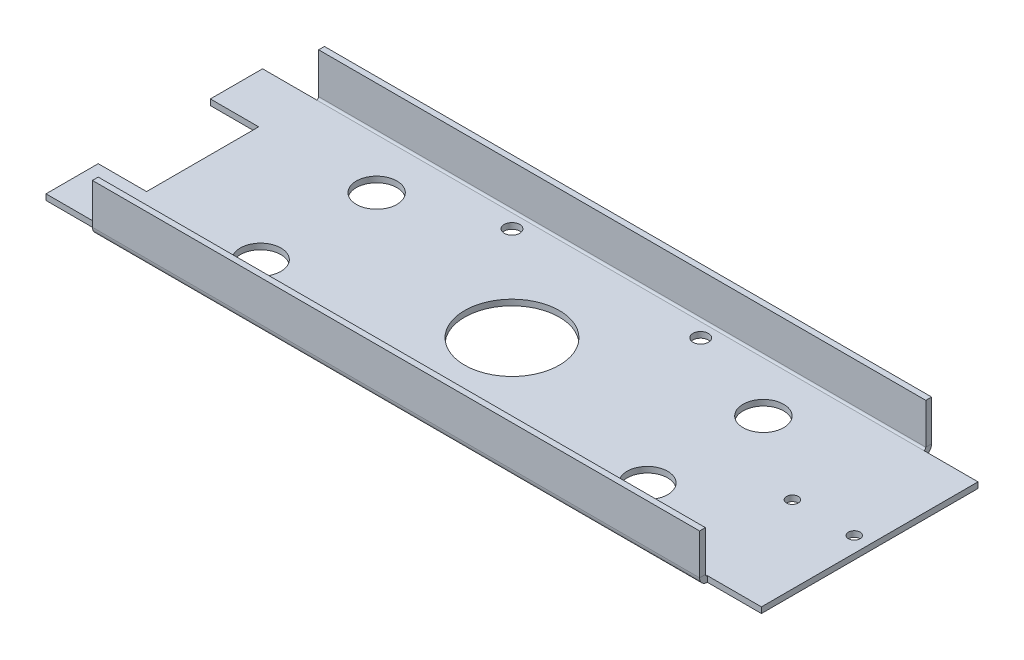
ISO-10303-21;
HEADER;
FILE_DESCRIPTION(('STEP AP214'),'2;1');
FILE_NAME('part.step','',(''),(''),'','','');
FILE_SCHEMA(('AUTOMOTIVE_DESIGN { 1 0 10303 214 1 1 1 1 }'));
ENDSEC;
DATA;
#1=APPLICATION_CONTEXT('core data for automotive mechanical design processes');
#2=APPLICATION_PROTOCOL_DEFINITION('international standard','automotive_design',2000,#1);
#3=PRODUCT_CONTEXT('',#1,'mechanical');
#4=PRODUCT('Part','Part','',(#3));
#5=PRODUCT_RELATED_PRODUCT_CATEGORY('part','',(#4));
#6=PRODUCT_DEFINITION_FORMATION('','',#4);
#7=PRODUCT_DEFINITION_CONTEXT('part definition',#1,'design');
#8=PRODUCT_DEFINITION('design','',#6,#7);
#9=PRODUCT_DEFINITION_SHAPE('','',#8);
#10=(LENGTH_UNIT() NAMED_UNIT(*) SI_UNIT(.MILLI.,.METRE.));
#11=(NAMED_UNIT(*) PLANE_ANGLE_UNIT() SI_UNIT($,.RADIAN.));
#12=(NAMED_UNIT(*) SI_UNIT($,.STERADIAN.) SOLID_ANGLE_UNIT());
#13=UNCERTAINTY_MEASURE_WITH_UNIT(LENGTH_MEASURE(1.E-05),#10,'distance_accuracy_value','');
#14=(GEOMETRIC_REPRESENTATION_CONTEXT(3) GLOBAL_UNCERTAINTY_ASSIGNED_CONTEXT((#13)) GLOBAL_UNIT_ASSIGNED_CONTEXT((#10,
#11,#12)) REPRESENTATION_CONTEXT('',''));
#15=CARTESIAN_POINT('',(0.,0.,0.));
#16=DIRECTION('',(0.,0.,1.));
#17=DIRECTION('',(1.,0.,0.));
#18=AXIS2_PLACEMENT_3D('',#15,#16,#17);
#19=CARTESIAN_POINT('',(185.,3.99999999999999,56.));
#20=DIRECTION('',(1.,0.,0.));
#21=DIRECTION('',(0.,0.,1.));
#22=AXIS2_PLACEMENT_3D('',#19,#20,#21);
#23=CYLINDRICAL_SURFACE('',#22,4.);
#24=DIRECTION('',(-1.,0.,0.));
#25=VECTOR('',#24,1.);
#26=CARTESIAN_POINT('',(0.,3.99999999999999,60.));
#27=LINE('',#26,#25);
#28=CARTESIAN_POINT('',(157.,4.00000000000002,60.));
#29=VERTEX_POINT('',#28);
#30=CARTESIAN_POINT('',(-157.,4.00000000000002,60.));
#31=VERTEX_POINT('',#30);
#32=EDGE_CURVE('E238',#29,#31,#27,.T.);
#33=ORIENTED_EDGE('',*,*,#32,.T.);
#34=CARTESIAN_POINT('',(-157.,3.99999999999999,56.));
#35=DIRECTION('',(1.,0.,0.));
#36=DIRECTION('',(0.,0.,-1.));
#37=AXIS2_PLACEMENT_3D('',#34,#35,#36);
#38=CIRCLE('',#37,4.);
#39=CARTESIAN_POINT('',(-157.,0.,56.));
#40=VERTEX_POINT('',#39);
#41=EDGE_CURVE('E436',#40,#31,#38,.F.);
#42=ORIENTED_EDGE('',*,*,#41,.F.);
#43=DIRECTION('',(1.,0.,0.));
#44=VECTOR('',#43,1.);
#45=CARTESIAN_POINT('',(185.,0.,56.));
#46=LINE('',#45,#44);
#47=CARTESIAN_POINT('',(157.,0.,56.));
#48=VERTEX_POINT('',#47);
#49=EDGE_CURVE('E252',#48,#40,#46,.F.);
#50=ORIENTED_EDGE('',*,*,#49,.F.);
#51=CARTESIAN_POINT('',(157.,3.99999999999999,56.));
#52=DIRECTION('',(1.,0.,0.));
#53=DIRECTION('',(0.,0.,-1.));
#54=AXIS2_PLACEMENT_3D('',#51,#52,#53);
#55=CIRCLE('',#54,4.);
#56=EDGE_CURVE('E490',#29,#48,#55,.T.);
#57=ORIENTED_EDGE('',*,*,#56,.F.);
#58=EDGE_LOOP('',(#33,#42,#50,#57));
#59=FACE_BOUND('',#58,.T.);
#60=ADVANCED_FACE('F38',(#59),#23,.T.);
#61=CARTESIAN_POINT('',(185.,3.99999999999999,56.));
#62=DIRECTION('',(1.,0.,0.));
#63=DIRECTION('',(0.,0.,1.));
#64=AXIS2_PLACEMENT_3D('',#61,#62,#63);
#65=CYLINDRICAL_SURFACE('',#64,1.);
#66=CARTESIAN_POINT('',(-157.,3.99999999999999,56.));
#67=DIRECTION('',(-1.,0.,0.));
#68=DIRECTION('',(0.,0.,1.));
#69=AXIS2_PLACEMENT_3D('',#66,#67,#68);
#70=CIRCLE('',#69,1.);
#71=CARTESIAN_POINT('',(-157.,2.99999999999999,56.));
#72=VERTEX_POINT('',#71);
#73=CARTESIAN_POINT('',(-157.,4.00000000000001,57.));
#74=VERTEX_POINT('',#73);
#75=EDGE_CURVE('E445',#72,#74,#70,.T.);
#76=ORIENTED_EDGE('',*,*,#75,.T.);
#77=DIRECTION('',(1.,0.,0.));
#78=VECTOR('',#77,1.);
#79=CARTESIAN_POINT('',(-185.,4.,57.));
#80=LINE('',#79,#78);
#81=CARTESIAN_POINT('',(157.,3.99999999999998,57.));
#82=VERTEX_POINT('',#81);
#83=EDGE_CURVE('E233',#74,#82,#80,.T.);
#84=ORIENTED_EDGE('',*,*,#83,.T.);
#85=CARTESIAN_POINT('',(157.,3.99999999999999,56.));
#86=DIRECTION('',(1.,0.,0.));
#87=DIRECTION('',(0.,0.,-1.));
#88=AXIS2_PLACEMENT_3D('',#85,#86,#87);
#89=CIRCLE('',#88,1.);
#90=CARTESIAN_POINT('',(157.,2.99999999999999,56.));
#91=VERTEX_POINT('',#90);
#92=EDGE_CURVE('E493',#82,#91,#89,.T.);
#93=ORIENTED_EDGE('',*,*,#92,.T.);
#94=DIRECTION('',(1.,0.,0.));
#95=VECTOR('',#94,1.);
#96=CARTESIAN_POINT('',(185.,2.99999999999999,56.));
#97=LINE('',#96,#95);
#98=EDGE_CURVE('E245',#91,#72,#97,.F.);
#99=ORIENTED_EDGE('',*,*,#98,.T.);
#100=EDGE_LOOP('',(#76,#84,#93,#99));
#101=FACE_BOUND('',#100,.T.);
#102=ADVANCED_FACE('F316',(#101),#65,.F.);
#103=CARTESIAN_POINT('',(0.,0.,60.));
#104=DIRECTION('',(0.,0.,-1.));
#105=DIRECTION('',(-1.,0.,0.));
#106=AXIS2_PLACEMENT_3D('',#103,#104,#105);
#107=PLANE('',#106);
#108=DIRECTION('',(0.,1.,0.));
#109=VECTOR('',#108,1.);
#110=CARTESIAN_POINT('',(-157.,0.,60.));
#111=LINE('',#110,#109);
#112=CARTESIAN_POINT('',(-157.,25.,60.));
#113=VERTEX_POINT('',#112);
#114=EDGE_CURVE('E55',#113,#31,#111,.F.);
#115=ORIENTED_EDGE('',*,*,#114,.T.);
#116=ORIENTED_EDGE('',*,*,#32,.F.);
#117=DIRECTION('',(0.,1.,0.));
#118=VECTOR('',#117,1.);
#119=CARTESIAN_POINT('',(157.,14.5,60.));
#120=LINE('',#119,#118);
#121=CARTESIAN_POINT('',(157.,25.,60.));
#122=VERTEX_POINT('',#121);
#123=EDGE_CURVE('E473',#122,#29,#120,.F.);
#124=ORIENTED_EDGE('',*,*,#123,.F.);
#125=DIRECTION('',(-1.,0.,0.));
#126=VECTOR('',#125,1.);
#127=CARTESIAN_POINT('',(-185.,25.,60.));
#128=LINE('',#127,#126);
#129=EDGE_CURVE('E242',#122,#113,#128,.T.);
#130=ORIENTED_EDGE('',*,*,#129,.T.);
#131=EDGE_LOOP('',(#115,#116,#124,#130));
#132=FACE_BOUND('',#131,.T.);
#133=ADVANCED_FACE('F322',(#132),#107,.F.);
#134=CARTESIAN_POINT('',(0.,0.,57.));
#135=DIRECTION('',(0.,0.,-1.));
#136=DIRECTION('',(-1.,0.,0.));
#137=AXIS2_PLACEMENT_3D('',#134,#135,#136);
#138=PLANE('',#137);
#139=ORIENTED_EDGE('',*,*,#83,.F.);
#140=DIRECTION('',(0.,-1.,0.));
#141=VECTOR('',#140,1.);
#142=CARTESIAN_POINT('',(-157.,0.,57.));
#143=LINE('',#142,#141);
#144=CARTESIAN_POINT('',(-157.,25.,57.));
#145=VERTEX_POINT('',#144);
#146=EDGE_CURVE('E448',#145,#74,#143,.T.);
#147=ORIENTED_EDGE('',*,*,#146,.F.);
#148=DIRECTION('',(-1.,0.,0.));
#149=VECTOR('',#148,1.);
#150=CARTESIAN_POINT('',(-185.,25.,57.));
#151=LINE('',#150,#149);
#152=CARTESIAN_POINT('',(157.,25.,57.));
#153=VERTEX_POINT('',#152);
#154=EDGE_CURVE('E241',#153,#145,#151,.T.);
#155=ORIENTED_EDGE('',*,*,#154,.F.);
#156=DIRECTION('',(0.,-1.,0.));
#157=VECTOR('',#156,1.);
#158=CARTESIAN_POINT('',(157.,25.,57.));
#159=LINE('',#158,#157);
#160=EDGE_CURVE('E63',#153,#82,#159,.T.);
#161=ORIENTED_EDGE('',*,*,#160,.T.);
#162=EDGE_LOOP('',(#139,#147,#155,#161));
#163=FACE_BOUND('',#162,.T.);
#164=ADVANCED_FACE('F570',(#163),#138,.T.);
#165=CARTESIAN_POINT('',(-185.,25.,60.));
#166=DIRECTION('',(0.,-1.,0.));
#167=DIRECTION('',(0.,0.,-1.));
#168=AXIS2_PLACEMENT_3D('',#165,#166,#167);
#169=PLANE('',#168);
#170=DIRECTION('',(0.,0.,-1.));
#171=VECTOR('',#170,1.);
#172=CARTESIAN_POINT('',(-157.,25.,57.));
#173=LINE('',#172,#171);
#174=EDGE_CURVE('E452',#145,#113,#173,.F.);
#175=ORIENTED_EDGE('',*,*,#174,.T.);
#176=ORIENTED_EDGE('',*,*,#129,.F.);
#177=DIRECTION('',(0.,0.,1.));
#178=VECTOR('',#177,1.);
#179=CARTESIAN_POINT('',(157.,25.,57.));
#180=LINE('',#179,#178);
#181=EDGE_CURVE('E472',#122,#153,#180,.F.);
#182=ORIENTED_EDGE('',*,*,#181,.T.);
#183=ORIENTED_EDGE('',*,*,#154,.T.);
#184=EDGE_LOOP('',(#175,#176,#182,#183));
#185=FACE_BOUND('',#184,.T.);
#186=ADVANCED_FACE('F326',(#185),#169,.F.);
#187=CARTESIAN_POINT('',(-185.,3.99999999999998,-56.));
#188=DIRECTION('',(-1.,0.,0.));
#189=DIRECTION('',(0.,0.,-1.));
#190=AXIS2_PLACEMENT_3D('',#187,#188,#189);
#191=CYLINDRICAL_SURFACE('',#190,4.);
#192=DIRECTION('',(1.,0.,0.));
#193=VECTOR('',#192,1.);
#194=CARTESIAN_POINT('',(0.,4.00000000000001,-60.));
#195=LINE('',#194,#193);
#196=CARTESIAN_POINT('',(-157.,3.99999999999997,-60.));
#197=VERTEX_POINT('',#196);
#198=CARTESIAN_POINT('',(157.,3.99999999999999,-60.));
#199=VERTEX_POINT('',#198);
#200=EDGE_CURVE('E204',#197,#199,#195,.T.);
#201=ORIENTED_EDGE('',*,*,#200,.T.);
#202=CARTESIAN_POINT('',(157.,3.99999999999998,-56.));
#203=DIRECTION('',(-1.,0.,0.));
#204=DIRECTION('',(0.,0.,1.));
#205=AXIS2_PLACEMENT_3D('',#202,#203,#204);
#206=CIRCLE('',#205,4.);
#207=CARTESIAN_POINT('',(157.,0.,-56.));
#208=VERTEX_POINT('',#207);
#209=EDGE_CURVE('E188',#208,#199,#206,.F.);
#210=ORIENTED_EDGE('',*,*,#209,.F.);
#211=DIRECTION('',(-1.,0.,0.));
#212=VECTOR('',#211,1.);
#213=CARTESIAN_POINT('',(-185.,0.,-56.));
#214=LINE('',#213,#212);
#215=CARTESIAN_POINT('',(-157.,0.,-56.));
#216=VERTEX_POINT('',#215);
#217=EDGE_CURVE('E228',#216,#208,#214,.F.);
#218=ORIENTED_EDGE('',*,*,#217,.F.);
#219=CARTESIAN_POINT('',(-157.,3.99999999999998,-56.));
#220=DIRECTION('',(1.,0.,0.));
#221=DIRECTION('',(0.,0.,-1.));
#222=AXIS2_PLACEMENT_3D('',#219,#220,#221);
#223=CIRCLE('',#222,4.);
#224=EDGE_CURVE('E211',#197,#216,#223,.F.);
#225=ORIENTED_EDGE('',*,*,#224,.F.);
#226=EDGE_LOOP('',(#201,#210,#218,#225));
#227=FACE_BOUND('',#226,.T.);
#228=ADVANCED_FACE('F210',(#227),#191,.T.);
#229=CARTESIAN_POINT('',(-185.,3.99999999999998,-56.));
#230=DIRECTION('',(-1.,0.,0.));
#231=DIRECTION('',(0.,0.,-1.));
#232=AXIS2_PLACEMENT_3D('',#229,#230,#231);
#233=CYLINDRICAL_SURFACE('',#232,1.);
#234=CARTESIAN_POINT('',(157.,3.99999999999998,-56.));
#235=DIRECTION('',(1.,0.,0.));
#236=DIRECTION('',(0.,0.,-1.));
#237=AXIS2_PLACEMENT_3D('',#234,#235,#236);
#238=CIRCLE('',#237,1.);
#239=CARTESIAN_POINT('',(157.,2.99999999999998,-56.));
#240=VERTEX_POINT('',#239);
#241=CARTESIAN_POINT('',(157.,3.99999999999999,-57.));
#242=VERTEX_POINT('',#241);
#243=EDGE_CURVE('E187',#240,#242,#238,.T.);
#244=ORIENTED_EDGE('',*,*,#243,.T.);
#245=DIRECTION('',(-1.,0.,0.));
#246=VECTOR('',#245,1.);
#247=CARTESIAN_POINT('',(185.,4.,-57.));
#248=LINE('',#247,#246);
#249=CARTESIAN_POINT('',(-157.,4.00000000000001,-57.));
#250=VERTEX_POINT('',#249);
#251=EDGE_CURVE('E213',#242,#250,#248,.T.);
#252=ORIENTED_EDGE('',*,*,#251,.T.);
#253=CARTESIAN_POINT('',(-157.,3.99999999999998,-56.));
#254=DIRECTION('',(-1.,0.,0.));
#255=DIRECTION('',(0.,0.,1.));
#256=AXIS2_PLACEMENT_3D('',#253,#254,#255);
#257=CIRCLE('',#256,1.);
#258=CARTESIAN_POINT('',(-157.,2.99999999999999,-56.));
#259=VERTEX_POINT('',#258);
#260=EDGE_CURVE('E481',#250,#259,#257,.T.);
#261=ORIENTED_EDGE('',*,*,#260,.T.);
#262=DIRECTION('',(-1.,0.,0.));
#263=VECTOR('',#262,1.);
#264=CARTESIAN_POINT('',(-185.,2.99999999999998,-56.));
#265=LINE('',#264,#263);
#266=EDGE_CURVE('E222',#259,#240,#265,.F.);
#267=ORIENTED_EDGE('',*,*,#266,.T.);
#268=EDGE_LOOP('',(#244,#252,#261,#267));
#269=FACE_BOUND('',#268,.T.);
#270=ADVANCED_FACE('F556',(#269),#233,.F.);
#271=CARTESIAN_POINT('',(0.,-2.08232920277885E-13,-60.));
#272=DIRECTION('',(0.,0.,1.));
#273=DIRECTION('',(0.,-1.,0.));
#274=AXIS2_PLACEMENT_3D('',#271,#272,#273);
#275=PLANE('',#274);
#276=DIRECTION('',(0.,-1.,0.));
#277=VECTOR('',#276,1.);
#278=CARTESIAN_POINT('',(157.,-2.08166817117217E-13,-60.));
#279=LINE('',#278,#277);
#280=CARTESIAN_POINT('',(157.,25.,-60.0000000000001));
#281=VERTEX_POINT('',#280);
#282=EDGE_CURVE('E180',#281,#199,#279,.T.);
#283=ORIENTED_EDGE('',*,*,#282,.T.);
#284=ORIENTED_EDGE('',*,*,#200,.F.);
#285=DIRECTION('',(0.,1.,0.));
#286=VECTOR('',#285,1.);
#287=CARTESIAN_POINT('',(-157.,14.5,-60.));
#288=LINE('',#287,#286);
#289=CARTESIAN_POINT('',(-157.,25.,-60.0000000000001));
#290=VERTEX_POINT('',#289);
#291=EDGE_CURVE('E458',#290,#197,#288,.F.);
#292=ORIENTED_EDGE('',*,*,#291,.F.);
#293=DIRECTION('',(1.,0.,0.));
#294=VECTOR('',#293,1.);
#295=CARTESIAN_POINT('',(185.,25.,-60.0000000000001));
#296=LINE('',#295,#294);
#297=EDGE_CURVE('E206',#290,#281,#296,.T.);
#298=ORIENTED_EDGE('',*,*,#297,.T.);
#299=EDGE_LOOP('',(#283,#284,#292,#298));
#300=FACE_BOUND('',#299,.T.);
#301=ADVANCED_FACE('F202',(#300),#275,.F.);
#302=CARTESIAN_POINT('',(0.,-1.97758476261356E-13,-57.));
#303=DIRECTION('',(0.,0.,1.));
#304=DIRECTION('',(0.,-1.,0.));
#305=AXIS2_PLACEMENT_3D('',#302,#303,#304);
#306=PLANE('',#305);
#307=ORIENTED_EDGE('',*,*,#251,.F.);
#308=DIRECTION('',(0.,-1.,0.));
#309=VECTOR('',#308,1.);
#310=CARTESIAN_POINT('',(157.,14.5,-57.));
#311=LINE('',#310,#309);
#312=CARTESIAN_POINT('',(157.,25.,-57.0000000000001));
#313=VERTEX_POINT('',#312);
#314=EDGE_CURVE('E183',#313,#242,#311,.T.);
#315=ORIENTED_EDGE('',*,*,#314,.F.);
#316=DIRECTION('',(1.,0.,0.));
#317=VECTOR('',#316,1.);
#318=CARTESIAN_POINT('',(185.,25.,-57.0000000000001));
#319=LINE('',#318,#317);
#320=CARTESIAN_POINT('',(-157.,25.,-57.0000000000001));
#321=VERTEX_POINT('',#320);
#322=EDGE_CURVE('E212',#321,#313,#319,.T.);
#323=ORIENTED_EDGE('',*,*,#322,.F.);
#324=DIRECTION('',(0.,-1.,0.));
#325=VECTOR('',#324,1.);
#326=CARTESIAN_POINT('',(-157.,25.0000000000001,-57.0000000000001));
#327=LINE('',#326,#325);
#328=EDGE_CURVE('E454',#321,#250,#327,.T.);
#329=ORIENTED_EDGE('',*,*,#328,.T.);
#330=EDGE_LOOP('',(#307,#315,#323,#329));
#331=FACE_BOUND('',#330,.T.);
#332=ADVANCED_FACE('F555',(#331),#306,.T.);
#333=CARTESIAN_POINT('',(185.,25.,-60.0000000000001));
#334=DIRECTION('',(0.,-1.,0.));
#335=DIRECTION('',(0.,0.,-1.));
#336=AXIS2_PLACEMENT_3D('',#333,#334,#335);
#337=PLANE('',#336);
#338=DIRECTION('',(0.,0.,1.));
#339=VECTOR('',#338,1.);
#340=CARTESIAN_POINT('',(157.,25.,-60.0000000000001));
#341=LINE('',#340,#339);
#342=EDGE_CURVE('E207',#313,#281,#341,.F.);
#343=ORIENTED_EDGE('',*,*,#342,.T.);
#344=ORIENTED_EDGE('',*,*,#297,.F.);
#345=DIRECTION('',(0.,0.,-1.));
#346=VECTOR('',#345,1.);
#347=CARTESIAN_POINT('',(-157.,25.,-57.0000000000001));
#348=LINE('',#347,#346);
#349=EDGE_CURVE('E457',#290,#321,#348,.F.);
#350=ORIENTED_EDGE('',*,*,#349,.T.);
#351=ORIENTED_EDGE('',*,*,#322,.T.);
#352=EDGE_LOOP('',(#343,#344,#350,#351));
#353=FACE_BOUND('',#352,.T.);
#354=ADVANCED_FACE('F559',(#353),#337,.F.);
#355=CARTESIAN_POINT('',(-185.,3.,57.));
#356=DIRECTION('',(1.,0.,0.));
#357=DIRECTION('',(0.,0.,1.));
#358=AXIS2_PLACEMENT_3D('',#355,#356,#357);
#359=PLANE('',#358);
#360=DIRECTION('',(0.,-1.,0.));
#361=VECTOR('',#360,1.);
#362=CARTESIAN_POINT('',(-185.,25.001,-29.));
#363=LINE('',#362,#361);
#364=CARTESIAN_POINT('',(-185.,3.,-29.));
#365=VERTEX_POINT('',#364);
#366=CARTESIAN_POINT('',(-185.,0.,-29.));
#367=VERTEX_POINT('',#366);
#368=EDGE_CURVE('E376',#365,#367,#363,.T.);
#369=ORIENTED_EDGE('',*,*,#368,.F.);
#370=DIRECTION('',(0.,0.,1.));
#371=VECTOR('',#370,1.);
#372=CARTESIAN_POINT('',(-185.,3.,57.));
#373=LINE('',#372,#371);
#374=CARTESIAN_POINT('',(-185.,2.99999999999999,-56.));
#375=VERTEX_POINT('',#374);
#376=EDGE_CURVE('E265',#375,#365,#373,.T.);
#377=ORIENTED_EDGE('',*,*,#376,.F.);
#378=DIRECTION('',(0.,-1.,0.));
#379=VECTOR('',#378,1.);
#380=CARTESIAN_POINT('',(-185.,2.99999999999998,-56.));
#381=LINE('',#380,#379);
#382=CARTESIAN_POINT('',(-185.,0.,-56.));
#383=VERTEX_POINT('',#382);
#384=EDGE_CURVE('E227',#375,#383,#381,.T.);
#385=ORIENTED_EDGE('',*,*,#384,.T.);
#386=DIRECTION('',(0.,0.,-1.));
#387=VECTOR('',#386,1.);
#388=CARTESIAN_POINT('',(-185.,0.,0.));
#389=LINE('',#388,#387);
#390=EDGE_CURVE('E282',#383,#367,#389,.F.);
#391=ORIENTED_EDGE('',*,*,#390,.T.);
#392=EDGE_LOOP('',(#369,#377,#385,#391));
#393=FACE_BOUND('',#392,.T.);
#394=ADVANCED_FACE('F332',(#393),#359,.F.);
#395=CARTESIAN_POINT('',(0.,3.,0.));
#396=DIRECTION('',(0.,-1.,0.));
#397=DIRECTION('',(0.,0.,-1.));
#398=AXIS2_PLACEMENT_3D('',#395,#396,#397);
#399=PLANE('',#398);
#400=CARTESIAN_POINT('',(-100.,3.,30.0000000000001));
#401=DIRECTION('',(0.,1.,0.));
#402=DIRECTION('',(0.,0.,-1.));
#403=AXIS2_PLACEMENT_3D('',#400,#401,#402);
#404=CIRCLE('',#403,10.5);
#405=CARTESIAN_POINT('',(-100.,3.,19.5000000000001));
#406=VERTEX_POINT('',#405);
#407=EDGE_CURVE('E510',#406,#406,#404,.T.);
#408=ORIENTED_EDGE('',*,*,#407,.F.);
#409=EDGE_LOOP('',(#408));
#410=FACE_BOUND('',#409,.T.);
#411=CARTESIAN_POINT('',(100.,3.,30.0000000000001));
#412=DIRECTION('',(0.,1.,0.));
#413=DIRECTION('',(0.,0.,1.));
#414=AXIS2_PLACEMENT_3D('',#411,#412,#413);
#415=CIRCLE('',#414,10.5);
#416=CARTESIAN_POINT('',(100.,3.,40.5000000000001));
#417=VERTEX_POINT('',#416);
#418=EDGE_CURVE('E504',#417,#417,#415,.T.);
#419=ORIENTED_EDGE('',*,*,#418,.F.);
#420=EDGE_LOOP('',(#419));
#421=FACE_BOUND('',#420,.T.);
#422=CARTESIAN_POINT('',(100.,3.,-30.0000000000001));
#423=DIRECTION('',(0.,1.,0.));
#424=DIRECTION('',(0.,0.,-1.));
#425=AXIS2_PLACEMENT_3D('',#422,#423,#424);
#426=CIRCLE('',#425,10.5);
#427=CARTESIAN_POINT('',(100.,3.,-40.5000000000001));
#428=VERTEX_POINT('',#427);
#429=EDGE_CURVE('E497',#428,#428,#426,.T.);
#430=ORIENTED_EDGE('',*,*,#429,.F.);
#431=EDGE_LOOP('',(#430));
#432=FACE_BOUND('',#431,.T.);
#433=CARTESIAN_POINT('',(-100.,3.,-30.0000000000001));
#434=DIRECTION('',(0.,1.,0.));
#435=DIRECTION('',(0.,0.,1.));
#436=AXIS2_PLACEMENT_3D('',#433,#434,#435);
#437=CIRCLE('',#436,10.5);
#438=CARTESIAN_POINT('',(-100.,3.,-19.5000000000001));
#439=VERTEX_POINT('',#438);
#440=EDGE_CURVE('E409',#439,#439,#437,.T.);
#441=ORIENTED_EDGE('',*,*,#440,.F.);
#442=EDGE_LOOP('',(#441));
#443=FACE_BOUND('',#442,.T.);
#444=CARTESIAN_POINT('',(177.,3.,0.));
#445=DIRECTION('',(0.,-1.,0.));
#446=DIRECTION('',(0.,0.,-1.));
#447=AXIS2_PLACEMENT_3D('',#444,#445,#446);
#448=CIRCLE('',#447,2.99999999999999);
#449=CARTESIAN_POINT('',(177.,3.,-3.));
#450=VERTEX_POINT('',#449);
#451=EDGE_CURVE('E218',#450,#450,#448,.F.);
#452=ORIENTED_EDGE('',*,*,#451,.F.);
#453=EDGE_LOOP('',(#452));
#454=FACE_BOUND('',#453,.T.);
#455=CARTESIAN_POINT('',(145.,3.,0.));
#456=DIRECTION('',(0.,-1.,0.));
#457=DIRECTION('',(0.,0.,-1.));
#458=AXIS2_PLACEMENT_3D('',#455,#456,#457);
#459=CIRCLE('',#458,2.99999999999999);
#460=CARTESIAN_POINT('',(145.,3.,-3.));
#461=VERTEX_POINT('',#460);
#462=EDGE_CURVE('E396',#461,#461,#459,.F.);
#463=ORIENTED_EDGE('',*,*,#462,.F.);
#464=EDGE_LOOP('',(#463));
#465=FACE_BOUND('',#464,.T.);
#466=CARTESIAN_POINT('',(-48.7903679018718,3.,-48.7903679018718));
#467=DIRECTION('',(0.,1.,0.));
#468=DIRECTION('',(0.,0.,1.));
#469=AXIS2_PLACEMENT_3D('',#466,#467,#468);
#470=CIRCLE('',#469,4.);
#471=CARTESIAN_POINT('',(-48.7903679018718,3.,-44.7903679018718));
#472=VERTEX_POINT('',#471);
#473=EDGE_CURVE('E268',#472,#472,#470,.T.);
#474=ORIENTED_EDGE('',*,*,#473,.F.);
#475=EDGE_LOOP('',(#474));
#476=FACE_BOUND('',#475,.T.);
#477=CARTESIAN_POINT('',(48.7903679018717,3.,-48.7903679018718));
#478=DIRECTION('',(0.,1.,0.));
#479=DIRECTION('',(0.,0.,1.));
#480=AXIS2_PLACEMENT_3D('',#477,#478,#479);
#481=CIRCLE('',#480,4.);
#482=CARTESIAN_POINT('',(48.7903679018717,3.,-44.7903679018718));
#483=VERTEX_POINT('',#482);
#484=EDGE_CURVE('E271',#483,#483,#481,.T.);
#485=ORIENTED_EDGE('',*,*,#484,.F.);
#486=EDGE_LOOP('',(#485));
#487=FACE_BOUND('',#486,.T.);
#488=CARTESIAN_POINT('',(48.7903679018717,3.,48.7903679018718));
#489=DIRECTION('',(0.,1.,0.));
#490=DIRECTION('',(0.,0.,1.));
#491=AXIS2_PLACEMENT_3D('',#488,#489,#490);
#492=CIRCLE('',#491,4.);
#493=CARTESIAN_POINT('',(48.7903679018717,3.,52.7903679018718));
#494=VERTEX_POINT('',#493);
#495=EDGE_CURVE('E274',#494,#494,#492,.T.);
#496=ORIENTED_EDGE('',*,*,#495,.F.);
#497=EDGE_LOOP('',(#496));
#498=FACE_BOUND('',#497,.T.);
#499=CARTESIAN_POINT('',(-48.7903679018718,3.,48.7903679018718));
#500=DIRECTION('',(0.,1.,0.));
#501=DIRECTION('',(0.,0.,1.));
#502=AXIS2_PLACEMENT_3D('',#499,#500,#501);
#503=CIRCLE('',#502,4.);
#504=CARTESIAN_POINT('',(-48.7903679018718,3.,52.7903679018718));
#505=VERTEX_POINT('',#504);
#506=EDGE_CURVE('E47',#505,#505,#503,.T.);
#507=ORIENTED_EDGE('',*,*,#506,.F.);
#508=EDGE_LOOP('',(#507));
#509=FACE_BOUND('',#508,.T.);
#510=CARTESIAN_POINT('',(0.,3.,0.));
#511=DIRECTION('',(0.,1.,0.));
#512=DIRECTION('',(0.,0.,1.));
#513=AXIS2_PLACEMENT_3D('',#510,#511,#512);
#514=CIRCLE('',#513,24.5);
#515=CARTESIAN_POINT('',(0.,3.,24.5));
#516=VERTEX_POINT('',#515);
#517=EDGE_CURVE('E11',#516,#516,#514,.T.);
#518=ORIENTED_EDGE('',*,*,#517,.F.);
#519=EDGE_LOOP('',(#518));
#520=FACE_BOUND('',#519,.T.);
#521=ORIENTED_EDGE('',*,*,#376,.T.);
#522=DIRECTION('',(-1.,0.,0.));
#523=VECTOR('',#522,1.);
#524=CARTESIAN_POINT('',(-160.,3.,-29.));
#525=LINE('',#524,#523);
#526=CARTESIAN_POINT('',(-160.,3.,-29.));
#527=VERTEX_POINT('',#526);
#528=EDGE_CURVE('E371',#527,#365,#525,.T.);
#529=ORIENTED_EDGE('',*,*,#528,.F.);
#530=DIRECTION('',(0.,0.,-1.));
#531=VECTOR('',#530,1.);
#532=CARTESIAN_POINT('',(-160.,3.,29.));
#533=LINE('',#532,#531);
#534=CARTESIAN_POINT('',(-160.,3.,29.));
#535=VERTEX_POINT('',#534);
#536=EDGE_CURVE('E406',#535,#527,#533,.T.);
#537=ORIENTED_EDGE('',*,*,#536,.F.);
#538=DIRECTION('',(1.,0.,0.));
#539=VECTOR('',#538,1.);
#540=CARTESIAN_POINT('',(-160.,3.,29.));
#541=LINE('',#540,#539);
#542=CARTESIAN_POINT('',(-185.,2.99999999999999,29.));
#543=VERTEX_POINT('',#542);
#544=EDGE_CURVE('E383',#543,#535,#541,.T.);
#545=ORIENTED_EDGE('',*,*,#544,.F.);
#546=CARTESIAN_POINT('',(-185.,2.99999999999999,56.));
#547=VERTEX_POINT('',#546);
#548=EDGE_CURVE('E264',#543,#547,#373,.T.);
#549=ORIENTED_EDGE('',*,*,#548,.T.);
#550=DIRECTION('',(1.,0.,0.));
#551=VECTOR('',#550,1.);
#552=CARTESIAN_POINT('',(185.,2.99999999999997,56.));
#553=LINE('',#552,#551);
#554=EDGE_CURVE('E431',#72,#547,#553,.F.);
#555=ORIENTED_EDGE('',*,*,#554,.F.);
#556=ORIENTED_EDGE('',*,*,#98,.F.);
#557=CARTESIAN_POINT('',(185.,2.99999999999999,56.));
#558=VERTEX_POINT('',#557);
#559=EDGE_CURVE('E253',#558,#91,#97,.F.);
#560=ORIENTED_EDGE('',*,*,#559,.F.);
#561=DIRECTION('',(0.,0.,-1.));
#562=VECTOR('',#561,1.);
#563=CARTESIAN_POINT('',(185.,3.,57.));
#564=LINE('',#563,#562);
#565=CARTESIAN_POINT('',(185.,2.99999999999998,-56.));
#566=VERTEX_POINT('',#565);
#567=EDGE_CURVE('E261',#558,#566,#564,.T.);
#568=ORIENTED_EDGE('',*,*,#567,.T.);
#569=DIRECTION('',(-1.,0.,0.));
#570=VECTOR('',#569,1.);
#571=CARTESIAN_POINT('',(-185.,2.99999999999996,-56.));
#572=LINE('',#571,#570);
#573=EDGE_CURVE('E464',#240,#566,#572,.F.);
#574=ORIENTED_EDGE('',*,*,#573,.F.);
#575=ORIENTED_EDGE('',*,*,#266,.F.);
#576=EDGE_CURVE('E229',#375,#259,#265,.F.);
#577=ORIENTED_EDGE('',*,*,#576,.F.);
#578=EDGE_LOOP('',(#521,#529,#537,#545,#549,#555,#556,#560,#568,#574,#575,#577));
#579=FACE_BOUND('',#578,.T.);
#580=ADVANCED_FACE('F329',(#410,#421,#432,#443,#454,#465,#476,#487,#498,#509,#520,#579),#399,.F.);
#581=CARTESIAN_POINT('',(0.,0.,0.));
#582=DIRECTION('',(0.,-1.,0.));
#583=DIRECTION('',(0.,0.,-1.));
#584=AXIS2_PLACEMENT_3D('',#581,#582,#583);
#585=PLANE('',#584);
#586=CARTESIAN_POINT('',(-100.,0.,30.0000000000001));
#587=DIRECTION('',(0.,-1.,0.));
#588=DIRECTION('',(0.,0.,-1.));
#589=AXIS2_PLACEMENT_3D('',#586,#587,#588);
#590=CIRCLE('',#589,10.5);
#591=CARTESIAN_POINT('',(-100.,0.,19.5000000000001));
#592=VERTEX_POINT('',#591);
#593=EDGE_CURVE('E496',#592,#592,#590,.F.);
#594=ORIENTED_EDGE('',*,*,#593,.T.);
#595=EDGE_LOOP('',(#594));
#596=FACE_BOUND('',#595,.T.);
#597=CARTESIAN_POINT('',(100.,0.,30.0000000000001));
#598=DIRECTION('',(0.,-1.,0.));
#599=DIRECTION('',(0.,0.,-1.));
#600=AXIS2_PLACEMENT_3D('',#597,#598,#599);
#601=CIRCLE('',#600,10.5);
#602=CARTESIAN_POINT('',(100.,0.,19.5000000000001));
#603=VERTEX_POINT('',#602);
#604=EDGE_CURVE('E507',#603,#603,#601,.F.);
#605=ORIENTED_EDGE('',*,*,#604,.T.);
#606=EDGE_LOOP('',(#605));
#607=FACE_BOUND('',#606,.T.);
#608=CARTESIAN_POINT('',(100.,0.,-30.0000000000001));
#609=DIRECTION('',(0.,-1.,0.));
#610=DIRECTION('',(0.,0.,-1.));
#611=AXIS2_PLACEMENT_3D('',#608,#609,#610);
#612=CIRCLE('',#611,10.5);
#613=CARTESIAN_POINT('',(100.,0.,-40.5000000000001));
#614=VERTEX_POINT('',#613);
#615=EDGE_CURVE('E501',#614,#614,#612,.F.);
#616=ORIENTED_EDGE('',*,*,#615,.T.);
#617=EDGE_LOOP('',(#616));
#618=FACE_BOUND('',#617,.T.);
#619=CARTESIAN_POINT('',(-100.,0.,-30.0000000000001));
#620=DIRECTION('',(0.,-1.,0.));
#621=DIRECTION('',(0.,0.,-1.));
#622=AXIS2_PLACEMENT_3D('',#619,#620,#621);
#623=CIRCLE('',#622,10.5);
#624=CARTESIAN_POINT('',(-100.,0.,-40.5000000000001));
#625=VERTEX_POINT('',#624);
#626=EDGE_CURVE('E500',#625,#625,#623,.F.);
#627=ORIENTED_EDGE('',*,*,#626,.T.);
#628=EDGE_LOOP('',(#627));
#629=FACE_BOUND('',#628,.T.);
#630=CARTESIAN_POINT('',(177.,0.,0.));
#631=DIRECTION('',(0.,-1.,0.));
#632=DIRECTION('',(0.,0.,-1.));
#633=AXIS2_PLACEMENT_3D('',#630,#631,#632);
#634=CIRCLE('',#633,2.99999999999999);
#635=CARTESIAN_POINT('',(177.,0.,-3.));
#636=VERTEX_POINT('',#635);
#637=EDGE_CURVE('E401',#636,#636,#634,.T.);
#638=ORIENTED_EDGE('',*,*,#637,.F.);
#639=EDGE_LOOP('',(#638));
#640=FACE_BOUND('',#639,.T.);
#641=CARTESIAN_POINT('',(145.,0.,0.));
#642=DIRECTION('',(0.,-1.,0.));
#643=DIRECTION('',(0.,0.,-1.));
#644=AXIS2_PLACEMENT_3D('',#641,#642,#643);
#645=CIRCLE('',#644,2.99999999999999);
#646=CARTESIAN_POINT('',(145.,0.,-3.));
#647=VERTEX_POINT('',#646);
#648=EDGE_CURVE('E392',#647,#647,#645,.T.);
#649=ORIENTED_EDGE('',*,*,#648,.F.);
#650=EDGE_LOOP('',(#649));
#651=FACE_BOUND('',#650,.T.);
#652=DIRECTION('',(1.,0.,0.));
#653=VECTOR('',#652,1.);
#654=CARTESIAN_POINT('',(-160.,0.,-29.));
#655=LINE('',#654,#653);
#656=CARTESIAN_POINT('',(-160.,0.,-29.));
#657=VERTEX_POINT('',#656);
#658=EDGE_CURVE('E390',#367,#657,#655,.T.);
#659=ORIENTED_EDGE('',*,*,#658,.F.);
#660=ORIENTED_EDGE('',*,*,#390,.F.);
#661=EDGE_CURVE('E224',#383,#216,#214,.F.);
#662=ORIENTED_EDGE('',*,*,#661,.T.);
#663=ORIENTED_EDGE('',*,*,#217,.T.);
#664=DIRECTION('',(-1.,0.,0.));
#665=VECTOR('',#664,1.);
#666=CARTESIAN_POINT('',(-185.,0.,-56.));
#667=LINE('',#666,#665);
#668=CARTESIAN_POINT('',(185.,0.,-56.));
#669=VERTEX_POINT('',#668);
#670=EDGE_CURVE('E466',#208,#669,#667,.F.);
#671=ORIENTED_EDGE('',*,*,#670,.T.);
#672=DIRECTION('',(0.,0.,-1.));
#673=VECTOR('',#672,1.);
#674=CARTESIAN_POINT('',(185.,0.,0.));
#675=LINE('',#674,#673);
#676=CARTESIAN_POINT('',(185.,0.,56.));
#677=VERTEX_POINT('',#676);
#678=EDGE_CURVE('E258',#677,#669,#675,.T.);
#679=ORIENTED_EDGE('',*,*,#678,.F.);
#680=EDGE_CURVE('E248',#677,#48,#46,.F.);
#681=ORIENTED_EDGE('',*,*,#680,.T.);
#682=ORIENTED_EDGE('',*,*,#49,.T.);
#683=DIRECTION('',(1.,0.,0.));
#684=VECTOR('',#683,1.);
#685=CARTESIAN_POINT('',(185.,0.,56.));
#686=LINE('',#685,#684);
#687=CARTESIAN_POINT('',(-185.,0.,56.));
#688=VERTEX_POINT('',#687);
#689=EDGE_CURVE('E429',#40,#688,#686,.F.);
#690=ORIENTED_EDGE('',*,*,#689,.T.);
#691=CARTESIAN_POINT('',(-185.,0.,29.));
#692=VERTEX_POINT('',#691);
#693=EDGE_CURVE('E281',#692,#688,#389,.F.);
#694=ORIENTED_EDGE('',*,*,#693,.F.);
#695=DIRECTION('',(-1.,0.,0.));
#696=VECTOR('',#695,1.);
#697=CARTESIAN_POINT('',(-160.,0.,29.));
#698=LINE('',#697,#696);
#699=CARTESIAN_POINT('',(-160.,0.,29.));
#700=VERTEX_POINT('',#699);
#701=EDGE_CURVE('E414',#700,#692,#698,.T.);
#702=ORIENTED_EDGE('',*,*,#701,.F.);
#703=DIRECTION('',(0.,0.,1.));
#704=VECTOR('',#703,1.);
#705=CARTESIAN_POINT('',(-160.,0.,29.));
#706=LINE('',#705,#704);
#707=EDGE_CURVE('E411',#657,#700,#706,.T.);
#708=ORIENTED_EDGE('',*,*,#707,.F.);
#709=EDGE_LOOP('',(#659,#660,#662,#663,#671,#679,#681,#682,#690,#694,#702,#708));
#710=FACE_BOUND('',#709,.T.);
#711=CARTESIAN_POINT('',(-48.7903679018718,0.,-48.7903679018718));
#712=DIRECTION('',(0.,1.,0.));
#713=DIRECTION('',(0.,0.,1.));
#714=AXIS2_PLACEMENT_3D('',#711,#712,#713);
#715=CIRCLE('',#714,4.);
#716=CARTESIAN_POINT('',(-48.7903679018718,0.,-44.7903679018718));
#717=VERTEX_POINT('',#716);
#718=EDGE_CURVE('E285',#717,#717,#715,.T.);
#719=ORIENTED_EDGE('',*,*,#718,.T.);
#720=EDGE_LOOP('',(#719));
#721=FACE_BOUND('',#720,.T.);
#722=CARTESIAN_POINT('',(48.7903679018717,0.,-48.7903679018718));
#723=DIRECTION('',(0.,1.,0.));
#724=DIRECTION('',(0.,0.,1.));
#725=AXIS2_PLACEMENT_3D('',#722,#723,#724);
#726=CIRCLE('',#725,4.);
#727=CARTESIAN_POINT('',(48.7903679018717,0.,-44.7903679018718));
#728=VERTEX_POINT('',#727);
#729=EDGE_CURVE('E288',#728,#728,#726,.T.);
#730=ORIENTED_EDGE('',*,*,#729,.T.);
#731=EDGE_LOOP('',(#730));
#732=FACE_BOUND('',#731,.T.);
#733=CARTESIAN_POINT('',(48.7903679018717,0.,48.7903679018718));
#734=DIRECTION('',(0.,1.,0.));
#735=DIRECTION('',(0.,0.,1.));
#736=AXIS2_PLACEMENT_3D('',#733,#734,#735);
#737=CIRCLE('',#736,4.);
#738=CARTESIAN_POINT('',(48.7903679018717,0.,52.7903679018718));
#739=VERTEX_POINT('',#738);
#740=EDGE_CURVE('E291',#739,#739,#737,.T.);
#741=ORIENTED_EDGE('',*,*,#740,.T.);
#742=EDGE_LOOP('',(#741));
#743=FACE_BOUND('',#742,.T.);
#744=CARTESIAN_POINT('',(-48.7903679018718,0.,48.7903679018718));
#745=DIRECTION('',(0.,1.,0.));
#746=DIRECTION('',(0.,0.,1.));
#747=AXIS2_PLACEMENT_3D('',#744,#745,#746);
#748=CIRCLE('',#747,4.);
#749=CARTESIAN_POINT('',(-48.7903679018718,0.,52.7903679018718));
#750=VERTEX_POINT('',#749);
#751=EDGE_CURVE('E293',#750,#750,#748,.T.);
#752=ORIENTED_EDGE('',*,*,#751,.T.);
#753=EDGE_LOOP('',(#752));
#754=FACE_BOUND('',#753,.T.);
#755=CARTESIAN_POINT('',(0.,0.,0.));
#756=DIRECTION('',(0.,1.,0.));
#757=DIRECTION('',(0.,0.,1.));
#758=AXIS2_PLACEMENT_3D('',#755,#756,#757);
#759=CIRCLE('',#758,24.5);
#760=CARTESIAN_POINT('',(0.,0.,24.5));
#761=VERTEX_POINT('',#760);
#762=EDGE_CURVE('E42',#761,#761,#759,.T.);
#763=ORIENTED_EDGE('',*,*,#762,.T.);
#764=EDGE_LOOP('',(#763));
#765=FACE_BOUND('',#764,.T.);
#766=ADVANCED_FACE('F300',(#596,#607,#618,#629,#640,#651,#710,#721,#732,#743,#754,#765),#585,.T.);
#767=DIRECTION('',(0.,-1.,0.));
#768=VECTOR('',#767,1.);
#769=CARTESIAN_POINT('',(-185.,25.001,29.));
#770=LINE('',#769,#768);
#771=EDGE_CURVE('E381',#543,#692,#770,.T.);
#772=ORIENTED_EDGE('',*,*,#771,.T.);
#773=ORIENTED_EDGE('',*,*,#693,.T.);
#774=DIRECTION('',(0.,-1.,0.));
#775=VECTOR('',#774,1.);
#776=CARTESIAN_POINT('',(-185.,2.99999999999999,56.));
#777=LINE('',#776,#775);
#778=EDGE_CURVE('E256',#547,#688,#777,.T.);
#779=ORIENTED_EDGE('',*,*,#778,.F.);
#780=ORIENTED_EDGE('',*,*,#548,.F.);
#781=EDGE_LOOP('',(#772,#773,#779,#780));
#782=FACE_BOUND('',#781,.T.);
#783=ADVANCED_FACE('F336',(#782),#359,.F.);
#784=CARTESIAN_POINT('',(185.,3.,57.));
#785=DIRECTION('',(-1.,0.,0.));
#786=DIRECTION('',(0.,0.,-1.));
#787=AXIS2_PLACEMENT_3D('',#784,#785,#786);
#788=PLANE('',#787);
#789=DIRECTION('',(0.,-1.,0.));
#790=VECTOR('',#789,1.);
#791=CARTESIAN_POINT('',(185.,2.99999999999998,-56.));
#792=LINE('',#791,#790);
#793=EDGE_CURVE('E231',#566,#669,#792,.T.);
#794=ORIENTED_EDGE('',*,*,#793,.F.);
#795=ORIENTED_EDGE('',*,*,#567,.F.);
#796=DIRECTION('',(0.,-1.,0.));
#797=VECTOR('',#796,1.);
#798=CARTESIAN_POINT('',(185.,2.99999999999999,56.));
#799=LINE('',#798,#797);
#800=EDGE_CURVE('E251',#558,#677,#799,.T.);
#801=ORIENTED_EDGE('',*,*,#800,.T.);
#802=ORIENTED_EDGE('',*,*,#678,.T.);
#803=EDGE_LOOP('',(#794,#795,#801,#802));
#804=FACE_BOUND('',#803,.T.);
#805=ADVANCED_FACE('F338',(#804),#788,.F.);
#806=CARTESIAN_POINT('',(-48.7903679018718,3.,-48.7903679018718));
#807=DIRECTION('',(0.,-1.,0.));
#808=DIRECTION('',(0.,0.,-1.));
#809=AXIS2_PLACEMENT_3D('',#806,#807,#808);
#810=CYLINDRICAL_SURFACE('',#809,4.);
#811=ORIENTED_EDGE('',*,*,#473,.T.);
#812=EDGE_LOOP('',(#811));
#813=FACE_BOUND('',#812,.T.);
#814=ORIENTED_EDGE('',*,*,#718,.F.);
#815=EDGE_LOOP('',(#814));
#816=FACE_BOUND('',#815,.T.);
#817=ADVANCED_FACE('F341',(#813,#816),#810,.F.);
#818=CARTESIAN_POINT('',(48.7903679018717,3.,-48.7903679018718));
#819=DIRECTION('',(0.,-1.,0.));
#820=DIRECTION('',(0.,0.,-1.));
#821=AXIS2_PLACEMENT_3D('',#818,#819,#820);
#822=CYLINDRICAL_SURFACE('',#821,4.);
#823=ORIENTED_EDGE('',*,*,#484,.T.);
#824=EDGE_LOOP('',(#823));
#825=FACE_BOUND('',#824,.T.);
#826=ORIENTED_EDGE('',*,*,#729,.F.);
#827=EDGE_LOOP('',(#826));
#828=FACE_BOUND('',#827,.T.);
#829=ADVANCED_FACE('F348',(#825,#828),#822,.F.);
#830=CARTESIAN_POINT('',(48.7903679018717,3.,48.7903679018718));
#831=DIRECTION('',(0.,-1.,0.));
#832=DIRECTION('',(0.,0.,-1.));
#833=AXIS2_PLACEMENT_3D('',#830,#831,#832);
#834=CYLINDRICAL_SURFACE('',#833,4.);
#835=ORIENTED_EDGE('',*,*,#495,.T.);
#836=EDGE_LOOP('',(#835));
#837=FACE_BOUND('',#836,.T.);
#838=ORIENTED_EDGE('',*,*,#740,.F.);
#839=EDGE_LOOP('',(#838));
#840=FACE_BOUND('',#839,.T.);
#841=ADVANCED_FACE('F313',(#837,#840),#834,.F.);
#842=CARTESIAN_POINT('',(-48.7903679018718,3.,48.7903679018718));
#843=DIRECTION('',(0.,-1.,0.));
#844=DIRECTION('',(0.,0.,-1.));
#845=AXIS2_PLACEMENT_3D('',#842,#843,#844);
#846=CYLINDRICAL_SURFACE('',#845,4.);
#847=ORIENTED_EDGE('',*,*,#506,.T.);
#848=EDGE_LOOP('',(#847));
#849=FACE_BOUND('',#848,.T.);
#850=ORIENTED_EDGE('',*,*,#751,.F.);
#851=EDGE_LOOP('',(#850));
#852=FACE_BOUND('',#851,.T.);
#853=ADVANCED_FACE('F304',(#849,#852),#846,.F.);
#854=CARTESIAN_POINT('',(0.,3.,0.));
#855=DIRECTION('',(0.,-1.,0.));
#856=DIRECTION('',(0.,0.,-1.));
#857=AXIS2_PLACEMENT_3D('',#854,#855,#856);
#858=CYLINDRICAL_SURFACE('',#857,24.5);
#859=ORIENTED_EDGE('',*,*,#517,.T.);
#860=EDGE_LOOP('',(#859));
#861=FACE_BOUND('',#860,.T.);
#862=ORIENTED_EDGE('',*,*,#762,.F.);
#863=EDGE_LOOP('',(#862));
#864=FACE_BOUND('',#863,.T.);
#865=ADVANCED_FACE('F40',(#861,#864),#858,.F.);
#866=CARTESIAN_POINT('',(-160.,25.001,29.));
#867=DIRECTION('',(1.,0.,0.));
#868=DIRECTION('',(0.,0.,-1.));
#869=AXIS2_PLACEMENT_3D('',#866,#867,#868);
#870=PLANE('',#869);
#871=ORIENTED_EDGE('',*,*,#536,.T.);
#872=DIRECTION('',(0.,-1.,0.));
#873=VECTOR('',#872,1.);
#874=CARTESIAN_POINT('',(-160.,25.001,-29.));
#875=LINE('',#874,#873);
#876=EDGE_CURVE('E380',#527,#657,#875,.T.);
#877=ORIENTED_EDGE('',*,*,#876,.T.);
#878=ORIENTED_EDGE('',*,*,#707,.T.);
#879=DIRECTION('',(0.,-1.,0.));
#880=VECTOR('',#879,1.);
#881=CARTESIAN_POINT('',(-160.,25.001,29.));
#882=LINE('',#881,#880);
#883=EDGE_CURVE('E386',#535,#700,#882,.T.);
#884=ORIENTED_EDGE('',*,*,#883,.F.);
#885=EDGE_LOOP('',(#871,#877,#878,#884));
#886=FACE_BOUND('',#885,.T.);
#887=ADVANCED_FACE('F303',(#886),#870,.F.);
#888=CARTESIAN_POINT('',(-160.,25.001,-29.));
#889=DIRECTION('',(0.,0.,-1.));
#890=DIRECTION('',(-1.,0.,0.));
#891=AXIS2_PLACEMENT_3D('',#888,#889,#890);
#892=PLANE('',#891);
#893=ORIENTED_EDGE('',*,*,#528,.T.);
#894=ORIENTED_EDGE('',*,*,#368,.T.);
#895=ORIENTED_EDGE('',*,*,#658,.T.);
#896=ORIENTED_EDGE('',*,*,#876,.F.);
#897=EDGE_LOOP('',(#893,#894,#895,#896));
#898=FACE_BOUND('',#897,.T.);
#899=ADVANCED_FACE('F310',(#898),#892,.F.);
#900=CARTESIAN_POINT('',(-160.,25.001,29.));
#901=DIRECTION('',(0.,0.,1.));
#902=DIRECTION('',(1.,0.,0.));
#903=AXIS2_PLACEMENT_3D('',#900,#901,#902);
#904=PLANE('',#903);
#905=ORIENTED_EDGE('',*,*,#544,.T.);
#906=ORIENTED_EDGE('',*,*,#883,.T.);
#907=ORIENTED_EDGE('',*,*,#701,.T.);
#908=ORIENTED_EDGE('',*,*,#771,.F.);
#909=EDGE_LOOP('',(#905,#906,#907,#908));
#910=FACE_BOUND('',#909,.T.);
#911=ADVANCED_FACE('F540',(#910),#904,.F.);
#912=CARTESIAN_POINT('',(145.,25.001,0.));
#913=DIRECTION('',(0.,-1.,0.));
#914=DIRECTION('',(0.,0.,-1.));
#915=AXIS2_PLACEMENT_3D('',#912,#913,#914);
#916=CYLINDRICAL_SURFACE('',#915,2.99999999999999);
#917=ORIENTED_EDGE('',*,*,#648,.T.);
#918=EDGE_LOOP('',(#917));
#919=FACE_BOUND('',#918,.T.);
#920=ORIENTED_EDGE('',*,*,#462,.T.);
#921=EDGE_LOOP('',(#920));
#922=FACE_BOUND('',#921,.T.);
#923=ADVANCED_FACE('F538',(#919,#922),#916,.F.);
#924=CARTESIAN_POINT('',(177.,25.001,0.));
#925=DIRECTION('',(0.,-1.,0.));
#926=DIRECTION('',(0.,0.,-1.));
#927=AXIS2_PLACEMENT_3D('',#924,#925,#926);
#928=CYLINDRICAL_SURFACE('',#927,2.99999999999999);
#929=ORIENTED_EDGE('',*,*,#637,.T.);
#930=EDGE_LOOP('',(#929));
#931=FACE_BOUND('',#930,.T.);
#932=ORIENTED_EDGE('',*,*,#451,.T.);
#933=EDGE_LOOP('',(#932));
#934=FACE_BOUND('',#933,.T.);
#935=ADVANCED_FACE('F524',(#931,#934),#928,.F.);
#936=CARTESIAN_POINT('',(-100.,-0.00100000000001835,-30.0000000000001));
#937=DIRECTION('',(0.,1.,0.));
#938=DIRECTION('',(0.,0.,1.));
#939=AXIS2_PLACEMENT_3D('',#936,#937,#938);
#940=CYLINDRICAL_SURFACE('',#939,10.5);
#941=ORIENTED_EDGE('',*,*,#626,.F.);
#942=EDGE_LOOP('',(#941));
#943=FACE_BOUND('',#942,.T.);
#944=ORIENTED_EDGE('',*,*,#440,.T.);
#945=EDGE_LOOP('',(#944));
#946=FACE_BOUND('',#945,.T.);
#947=ADVANCED_FACE('F546',(#943,#946),#940,.F.);
#948=CARTESIAN_POINT('',(100.,-0.00100000000001835,-30.0000000000001));
#949=DIRECTION('',(0.,1.,0.));
#950=DIRECTION('',(0.,0.,1.));
#951=AXIS2_PLACEMENT_3D('',#948,#949,#950);
#952=CYLINDRICAL_SURFACE('',#951,10.5);
#953=ORIENTED_EDGE('',*,*,#615,.F.);
#954=EDGE_LOOP('',(#953));
#955=FACE_BOUND('',#954,.T.);
#956=ORIENTED_EDGE('',*,*,#429,.T.);
#957=EDGE_LOOP('',(#956));
#958=FACE_BOUND('',#957,.T.);
#959=ADVANCED_FACE('F633',(#955,#958),#952,.F.);
#960=CARTESIAN_POINT('',(100.,-0.00100000000001835,30.0000000000001));
#961=DIRECTION('',(0.,1.,0.));
#962=DIRECTION('',(0.,0.,1.));
#963=AXIS2_PLACEMENT_3D('',#960,#961,#962);
#964=CYLINDRICAL_SURFACE('',#963,10.5);
#965=ORIENTED_EDGE('',*,*,#604,.F.);
#966=EDGE_LOOP('',(#965));
#967=FACE_BOUND('',#966,.T.);
#968=ORIENTED_EDGE('',*,*,#418,.T.);
#969=EDGE_LOOP('',(#968));
#970=FACE_BOUND('',#969,.T.);
#971=ADVANCED_FACE('F636',(#967,#970),#964,.F.);
#972=CARTESIAN_POINT('',(-100.,-0.00100000000001835,30.0000000000001));
#973=DIRECTION('',(0.,1.,0.));
#974=DIRECTION('',(0.,0.,1.));
#975=AXIS2_PLACEMENT_3D('',#972,#973,#974);
#976=CYLINDRICAL_SURFACE('',#975,10.5);
#977=ORIENTED_EDGE('',*,*,#593,.F.);
#978=EDGE_LOOP('',(#977));
#979=FACE_BOUND('',#978,.T.);
#980=ORIENTED_EDGE('',*,*,#407,.T.);
#981=EDGE_LOOP('',(#980));
#982=FACE_BOUND('',#981,.T.);
#983=ADVANCED_FACE('F626',(#979,#982),#976,.F.);
#984=CARTESIAN_POINT('',(-157.,3.99999999999998,-56.));
#985=DIRECTION('',(-1.,0.,0.));
#986=DIRECTION('',(0.,0.,1.));
#987=AXIS2_PLACEMENT_3D('',#984,#985,#986);
#988=PLANE('',#987);
#989=ORIENTED_EDGE('',*,*,#224,.T.);
#990=DIRECTION('',(0.,1.,0.));
#991=VECTOR('',#990,1.);
#992=CARTESIAN_POINT('',(-157.,2.99999999999999,-56.));
#993=LINE('',#992,#991);
#994=EDGE_CURVE('E463',#259,#216,#993,.F.);
#995=ORIENTED_EDGE('',*,*,#994,.F.);
#996=ORIENTED_EDGE('',*,*,#260,.F.);
#997=DIRECTION('',(0.,0.,-1.));
#998=VECTOR('',#997,1.);
#999=CARTESIAN_POINT('',(-157.,3.99999999999997,-60.));
#1000=LINE('',#999,#998);
#1001=EDGE_CURVE('E476',#197,#250,#1000,.F.);
#1002=ORIENTED_EDGE('',*,*,#1001,.F.);
#1003=EDGE_LOOP('',(#989,#995,#996,#1002));
#1004=FACE_BOUND('',#1003,.T.);
#1005=ADVANCED_FACE('F599',(#1004),#988,.T.);
#1006=CARTESIAN_POINT('',(-171.,2.99999999999998,-56.));
#1007=DIRECTION('',(0.,0.,1.));
#1008=DIRECTION('',(-1.,0.,0.));
#1009=AXIS2_PLACEMENT_3D('',#1006,#1007,#1008);
#1010=PLANE('',#1009);
#1011=ORIENTED_EDGE('',*,*,#384,.F.);
#1012=ORIENTED_EDGE('',*,*,#576,.T.);
#1013=ORIENTED_EDGE('',*,*,#994,.T.);
#1014=ORIENTED_EDGE('',*,*,#661,.F.);
#1015=EDGE_LOOP('',(#1011,#1012,#1013,#1014));
#1016=FACE_BOUND('',#1015,.T.);
#1017=ADVANCED_FACE('F596',(#1016),#1010,.F.);
#1018=CARTESIAN_POINT('',(-157.,25.0000000000001,-57.0000000000001));
#1019=DIRECTION('',(1.,0.,0.));
#1020=DIRECTION('',(0.,-1.,0.));
#1021=AXIS2_PLACEMENT_3D('',#1018,#1019,#1020);
#1022=PLANE('',#1021);
#1023=ORIENTED_EDGE('',*,*,#349,.F.);
#1024=ORIENTED_EDGE('',*,*,#291,.T.);
#1025=ORIENTED_EDGE('',*,*,#1001,.T.);
#1026=ORIENTED_EDGE('',*,*,#328,.F.);
#1027=EDGE_LOOP('',(#1023,#1024,#1025,#1026));
#1028=FACE_BOUND('',#1027,.T.);
#1029=ADVANCED_FACE('F604',(#1028),#1022,.F.);
#1030=CARTESIAN_POINT('',(157.,3.99999999999998,-56.));
#1031=DIRECTION('',(-1.,0.,0.));
#1032=DIRECTION('',(0.,0.,1.));
#1033=AXIS2_PLACEMENT_3D('',#1030,#1031,#1032);
#1034=PLANE('',#1033);
#1035=DIRECTION('',(0.,-1.,0.));
#1036=VECTOR('',#1035,1.);
#1037=CARTESIAN_POINT('',(157.,2.99999999999999,-56.));
#1038=LINE('',#1037,#1036);
#1039=EDGE_CURVE('E192',#240,#208,#1038,.T.);
#1040=ORIENTED_EDGE('',*,*,#1039,.T.);
#1041=ORIENTED_EDGE('',*,*,#209,.T.);
#1042=DIRECTION('',(0.,0.,1.));
#1043=VECTOR('',#1042,1.);
#1044=CARTESIAN_POINT('',(157.,3.99999999999998,-60.));
#1045=LINE('',#1044,#1043);
#1046=EDGE_CURVE('E176',#199,#242,#1045,.T.);
#1047=ORIENTED_EDGE('',*,*,#1046,.T.);
#1048=ORIENTED_EDGE('',*,*,#243,.F.);
#1049=EDGE_LOOP('',(#1040,#1041,#1047,#1048));
#1050=FACE_BOUND('',#1049,.T.);
#1051=ADVANCED_FACE('F191',(#1050),#1034,.F.);
#1052=CARTESIAN_POINT('',(171.,2.99999999999996,-56.));
#1053=DIRECTION('',(0.,0.,1.));
#1054=DIRECTION('',(-1.,0.,0.));
#1055=AXIS2_PLACEMENT_3D('',#1052,#1053,#1054);
#1056=PLANE('',#1055);
#1057=ORIENTED_EDGE('',*,*,#573,.T.);
#1058=ORIENTED_EDGE('',*,*,#793,.T.);
#1059=ORIENTED_EDGE('',*,*,#670,.F.);
#1060=ORIENTED_EDGE('',*,*,#1039,.F.);
#1061=EDGE_LOOP('',(#1057,#1058,#1059,#1060));
#1062=FACE_BOUND('',#1061,.T.);
#1063=ADVANCED_FACE('F594',(#1062),#1056,.F.);
#1064=CARTESIAN_POINT('',(157.,-2.08166817117217E-13,-60.));
#1065=DIRECTION('',(-1.,0.,0.));
#1066=DIRECTION('',(0.,-1.,0.));
#1067=AXIS2_PLACEMENT_3D('',#1064,#1065,#1066);
#1068=PLANE('',#1067);
#1069=ORIENTED_EDGE('',*,*,#342,.F.);
#1070=ORIENTED_EDGE('',*,*,#314,.T.);
#1071=ORIENTED_EDGE('',*,*,#1046,.F.);
#1072=ORIENTED_EDGE('',*,*,#282,.F.);
#1073=EDGE_LOOP('',(#1069,#1070,#1071,#1072));
#1074=FACE_BOUND('',#1073,.T.);
#1075=ADVANCED_FACE('F178',(#1074),#1068,.F.);
#1076=CARTESIAN_POINT('',(157.,3.99999999999999,56.));
#1077=DIRECTION('',(-1.,0.,0.));
#1078=DIRECTION('',(0.,0.,1.));
#1079=AXIS2_PLACEMENT_3D('',#1076,#1077,#1078);
#1080=PLANE('',#1079);
#1081=DIRECTION('',(0.,0.,-1.));
#1082=VECTOR('',#1081,1.);
#1083=CARTESIAN_POINT('',(157.,4.00000000000002,60.));
#1084=LINE('',#1083,#1082);
#1085=EDGE_CURVE('E488',#29,#82,#1084,.T.);
#1086=ORIENTED_EDGE('',*,*,#1085,.F.);
#1087=ORIENTED_EDGE('',*,*,#56,.T.);
#1088=DIRECTION('',(0.,-1.,0.));
#1089=VECTOR('',#1088,1.);
#1090=CARTESIAN_POINT('',(157.,2.99999999999999,56.));
#1091=LINE('',#1090,#1089);
#1092=EDGE_CURVE('E478',#91,#48,#1091,.T.);
#1093=ORIENTED_EDGE('',*,*,#1092,.F.);
#1094=ORIENTED_EDGE('',*,*,#92,.F.);
#1095=EDGE_LOOP('',(#1086,#1087,#1093,#1094));
#1096=FACE_BOUND('',#1095,.T.);
#1097=ADVANCED_FACE('F629',(#1096),#1080,.F.);
#1098=CARTESIAN_POINT('',(171.,2.99999999999999,56.));
#1099=DIRECTION('',(0.,0.,-1.));
#1100=DIRECTION('',(1.,0.,0.));
#1101=AXIS2_PLACEMENT_3D('',#1098,#1099,#1100);
#1102=PLANE('',#1101);
#1103=ORIENTED_EDGE('',*,*,#800,.F.);
#1104=ORIENTED_EDGE('',*,*,#559,.T.);
#1105=ORIENTED_EDGE('',*,*,#1092,.T.);
#1106=ORIENTED_EDGE('',*,*,#680,.F.);
#1107=EDGE_LOOP('',(#1103,#1104,#1105,#1106));
#1108=FACE_BOUND('',#1107,.T.);
#1109=ADVANCED_FACE('F622',(#1108),#1102,.F.);
#1110=CARTESIAN_POINT('',(157.,25.,57.));
#1111=DIRECTION('',(-1.,0.,0.));
#1112=DIRECTION('',(0.,-1.,0.));
#1113=AXIS2_PLACEMENT_3D('',#1110,#1111,#1112);
#1114=PLANE('',#1113);
#1115=ORIENTED_EDGE('',*,*,#181,.F.);
#1116=ORIENTED_EDGE('',*,*,#123,.T.);
#1117=ORIENTED_EDGE('',*,*,#1085,.T.);
#1118=ORIENTED_EDGE('',*,*,#160,.F.);
#1119=EDGE_LOOP('',(#1115,#1116,#1117,#1118));
#1120=FACE_BOUND('',#1119,.T.);
#1121=ADVANCED_FACE('F620',(#1120),#1114,.F.);
#1122=CARTESIAN_POINT('',(-157.,0.,57.));
#1123=DIRECTION('',(1.,0.,0.));
#1124=DIRECTION('',(0.,-1.,0.));
#1125=AXIS2_PLACEMENT_3D('',#1122,#1123,#1124);
#1126=PLANE('',#1125);
#1127=ORIENTED_EDGE('',*,*,#146,.T.);
#1128=DIRECTION('',(0.,0.,-1.));
#1129=VECTOR('',#1128,1.);
#1130=CARTESIAN_POINT('',(-157.,4.,60.));
#1131=LINE('',#1130,#1129);
#1132=EDGE_CURVE('E443',#31,#74,#1131,.T.);
#1133=ORIENTED_EDGE('',*,*,#1132,.F.);
#1134=ORIENTED_EDGE('',*,*,#114,.F.);
#1135=ORIENTED_EDGE('',*,*,#174,.F.);
#1136=EDGE_LOOP('',(#1127,#1133,#1134,#1135));
#1137=FACE_BOUND('',#1136,.T.);
#1138=ADVANCED_FACE('F616',(#1137),#1126,.F.);
#1139=CARTESIAN_POINT('',(-157.,3.99999999999999,56.));
#1140=DIRECTION('',(1.,0.,0.));
#1141=DIRECTION('',(0.,0.,-1.));
#1142=AXIS2_PLACEMENT_3D('',#1139,#1140,#1141);
#1143=PLANE('',#1142);
#1144=DIRECTION('',(0.,-1.,0.));
#1145=VECTOR('',#1144,1.);
#1146=CARTESIAN_POINT('',(-157.,2.99999999999999,56.));
#1147=LINE('',#1146,#1145);
#1148=EDGE_CURVE('E434',#72,#40,#1147,.T.);
#1149=ORIENTED_EDGE('',*,*,#1148,.T.);
#1150=ORIENTED_EDGE('',*,*,#41,.T.);
#1151=ORIENTED_EDGE('',*,*,#1132,.T.);
#1152=ORIENTED_EDGE('',*,*,#75,.F.);
#1153=EDGE_LOOP('',(#1149,#1150,#1151,#1152));
#1154=FACE_BOUND('',#1153,.T.);
#1155=ADVANCED_FACE('F586',(#1154),#1143,.F.);
#1156=CARTESIAN_POINT('',(-171.,2.99999999999997,56.));
#1157=DIRECTION('',(0.,0.,-1.));
#1158=DIRECTION('',(1.,0.,0.));
#1159=AXIS2_PLACEMENT_3D('',#1156,#1157,#1158);
#1160=PLANE('',#1159);
#1161=ORIENTED_EDGE('',*,*,#554,.T.);
#1162=ORIENTED_EDGE('',*,*,#778,.T.);
#1163=ORIENTED_EDGE('',*,*,#689,.F.);
#1164=ORIENTED_EDGE('',*,*,#1148,.F.);
#1165=EDGE_LOOP('',(#1161,#1162,#1163,#1164));
#1166=FACE_BOUND('',#1165,.T.);
#1167=ADVANCED_FACE('F428',(#1166),#1160,.F.);
#1168=CLOSED_SHELL('',(#60,#102,#133,#164,#186,#228,#270,#301,#332,#354,#394,#580,#766,#783,
#805,#817,#829,#841,#853,#865,#887,#899,#911,#923,#935,#947,#959,#971,#983,#1005,#1017,#1029,
#1051,#1063,#1075,#1097,#1109,#1121,#1138,#1155,#1167));
#1169=MANIFOLD_SOLID_BREP('B2',#1168);
#1170=ADVANCED_BREP_SHAPE_REPRESENTATION('',(#18,#1169),#14);
#1171=SHAPE_DEFINITION_REPRESENTATION(#9,#1170);
ENDSEC;
END-ISO-10303-21;
